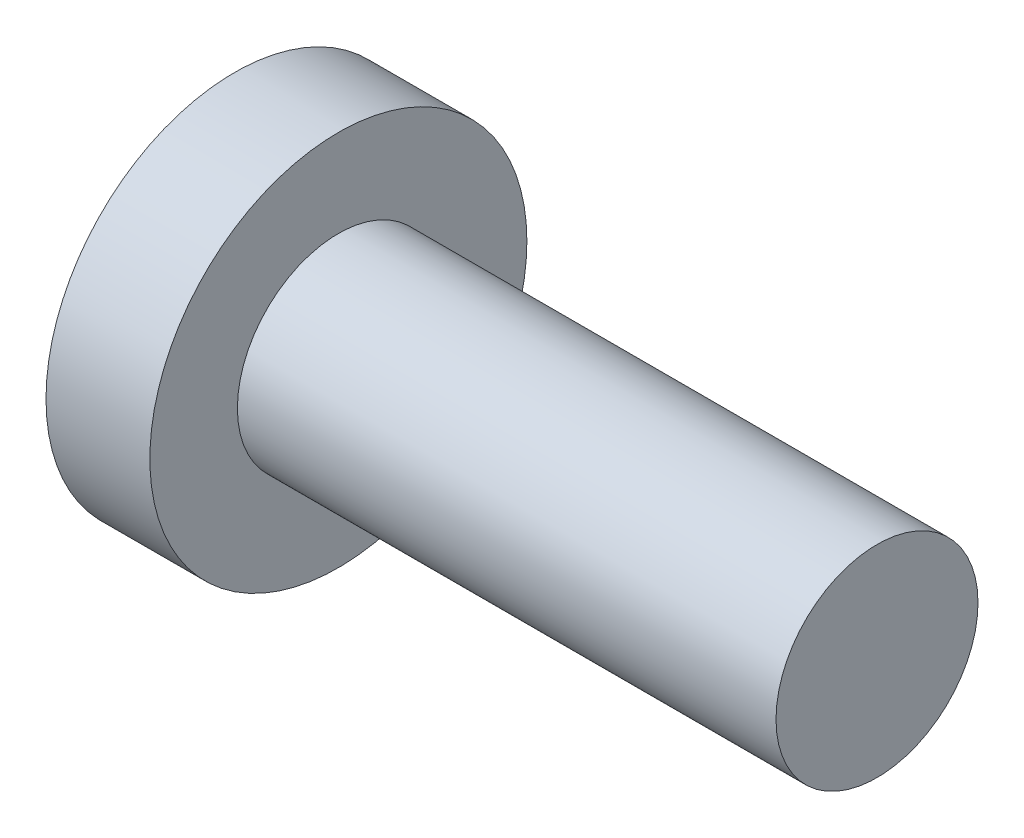
ISO-10303-21;
HEADER;
FILE_DESCRIPTION(('STEP AP214'),'2;1');
FILE_NAME('part.step','',(''),(''),'','','');
FILE_SCHEMA(('AUTOMOTIVE_DESIGN { 1 0 10303 214 1 1 1 1 }'));
ENDSEC;
DATA;
#1=APPLICATION_CONTEXT('core data for automotive mechanical design processes');
#2=APPLICATION_PROTOCOL_DEFINITION('international standard','automotive_design',2000,#1);
#3=PRODUCT_CONTEXT('',#1,'mechanical');
#4=PRODUCT('Part','Part','',(#3));
#5=PRODUCT_RELATED_PRODUCT_CATEGORY('part','',(#4));
#6=PRODUCT_DEFINITION_FORMATION('','',#4);
#7=PRODUCT_DEFINITION_CONTEXT('part definition',#1,'design');
#8=PRODUCT_DEFINITION('design','',#6,#7);
#9=PRODUCT_DEFINITION_SHAPE('','',#8);
#10=(LENGTH_UNIT() NAMED_UNIT(*) SI_UNIT(.MILLI.,.METRE.));
#11=(NAMED_UNIT(*) PLANE_ANGLE_UNIT() SI_UNIT($,.RADIAN.));
#12=(NAMED_UNIT(*) SI_UNIT($,.STERADIAN.) SOLID_ANGLE_UNIT());
#13=UNCERTAINTY_MEASURE_WITH_UNIT(LENGTH_MEASURE(1.E-05),#10,'distance_accuracy_value','');
#14=(GEOMETRIC_REPRESENTATION_CONTEXT(3) GLOBAL_UNCERTAINTY_ASSIGNED_CONTEXT((#13)) GLOBAL_UNIT_ASSIGNED_CONTEXT((#10,
#11,#12)) REPRESENTATION_CONTEXT('',''));
#15=CARTESIAN_POINT('',(0.,0.,0.));
#16=DIRECTION('',(0.,0.,1.));
#17=DIRECTION('',(1.,0.,0.));
#18=AXIS2_PLACEMENT_3D('',#15,#16,#17);
#19=CARTESIAN_POINT('',(5.,0.,0.));
#20=DIRECTION('',(1.,0.,0.));
#21=DIRECTION('',(0.,1.,0.));
#22=AXIS2_PLACEMENT_3D('',#19,#20,#21);
#23=SPHERICAL_SURFACE('',#22,5.);
#24=CARTESIAN_POINT('',(0.857536964558404,0.,0.));
#25=DIRECTION('',(1.,0.,0.));
#26=DIRECTION('',(0.,0.,-1.));
#27=AXIS2_PLACEMENT_3D('',#24,#25,#26);
#28=CIRCLE('',#27,2.8);
#29=CARTESIAN_POINT('',(0.857536964558404,0.,-2.8));
#30=VERTEX_POINT('',#29);
#31=EDGE_CURVE('E236',#30,#30,#28,.T.);
#32=ORIENTED_EDGE('',*,*,#31,.F.);
#33=EDGE_LOOP('',(#32));
#34=FACE_BOUND('',#33,.T.);
#35=CARTESIAN_POINT('',(5.,-0.3,0.));
#36=DIRECTION('',(0.,1.,0.));
#37=DIRECTION('',(0.,0.,1.));
#38=AXIS2_PLACEMENT_3D('',#35,#36,#37);
#39=CIRCLE('',#38,4.99099188538711);
#40=CARTESIAN_POINT('',(0.204192141108151,-0.3,1.3821096123648));
#41=VERTEX_POINT('',#40);
#42=CARTESIAN_POINT('',(0.0452043432650024,-0.3,0.6));
#43=VERTEX_POINT('',#42);
#44=EDGE_CURVE('E162',#41,#43,#39,.F.);
#45=ORIENTED_EDGE('',*,*,#44,.T.);
#46=CARTESIAN_POINT('',(0.0452043432650024,-0.3,0.6));
#47=CARTESIAN_POINT('',(0.0431803765733258,-0.299985307216759,0.58330066442328));
#48=CARTESIAN_POINT('',(0.0413275176268076,-0.301393621844251,0.56658131014707));
#49=CARTESIAN_POINT('',(0.0380100157488106,-0.306971694528783,0.533576799844294));
#50=CARTESIAN_POINT('',(0.0365452230698608,-0.311140385229224,0.517291478520808));
#51=CARTESIAN_POINT('',(0.0340472247062486,-0.322159146630374,0.485603015386071));
#52=CARTESIAN_POINT('',(0.0330143639783939,-0.329011352060552,0.470200587124305));
#53=CARTESIAN_POINT('',(0.0314127307694625,-0.345205676257373,0.440745323067069));
#54=CARTESIAN_POINT('',(0.0308438058607194,-0.354546975884403,0.426692045343612));
#55=CARTESIAN_POINT('',(0.0301895329231602,-0.375375503630217,0.400444519821415));
#56=CARTESIAN_POINT('',(0.0301004392402797,-0.386845384782284,0.38823659768892));
#57=CARTESIAN_POINT('',(0.0303984595749411,-0.411653153039893,0.365897305977699));
#58=CARTESIAN_POINT('',(0.0307856444365276,-0.424991317781719,0.355766245583269));
#59=CARTESIAN_POINT('',(0.0320223810339676,-0.453099677373167,0.337899284835798));
#60=CARTESIAN_POINT('',(0.0328703456862312,-0.467864814543113,0.33015530522925));
#61=CARTESIAN_POINT('',(0.0350026994062988,-0.498444042646254,0.317225069756468));
#62=CARTESIAN_POINT('',(0.0362869304045913,-0.514257751989369,0.312037889168157));
#63=CARTESIAN_POINT('',(0.0388210734003054,-0.541786224745504,0.305467740201196));
#64=CARTESIAN_POINT('',(0.0399723661586706,-0.553355690495333,0.303417160437875));
#65=CARTESIAN_POINT('',(0.0424563450668788,-0.576618891467464,0.300683149774227));
#66=CARTESIAN_POINT('',(0.0437887689490354,-0.588312424882147,0.299997764205199));
#67=CARTESIAN_POINT('',(0.0452043432650023,-0.6,0.3));
#68=B_SPLINE_CURVE_WITH_KNOTS('',3,(#46,#47,#48,#49,#50,#51,#52,#53,#54,#55,#56,#57,#58,#59,#60,
#61,#62,#63,#64,#65,#66,#67),.UNSPECIFIED.,.F.,.F.,(4,2,2,2,2,2,2,2,2,2,4),(0.,
0.0504040124836523,0.100788546583663,0.151213243139993,0.201621365810884,0.251635416538133,
0.3016569075042,0.351507189411116,0.401339428623963,0.436680545510309,0.471971024931029),.UNSPECIFIED.);
#69=CARTESIAN_POINT('',(0.0452043432650024,-0.6,0.3));
#70=VERTEX_POINT('',#69);
#71=EDGE_CURVE('E147',#43,#70,#68,.T.);
#72=ORIENTED_EDGE('',*,*,#71,.T.);
#73=CARTESIAN_POINT('',(5.,0.,0.3));
#74=DIRECTION('',(0.,0.,-1.));
#75=DIRECTION('',(0.,1.,0.));
#76=AXIS2_PLACEMENT_3D('',#73,#74,#75);
#77=CIRCLE('',#76,4.99099188538711);
#78=CARTESIAN_POINT('',(0.204192141108152,-1.3821096123648,0.299999999999999));
#79=VERTEX_POINT('',#78);
#80=EDGE_CURVE('E171',#70,#79,#77,.F.);
#81=ORIENTED_EDGE('',*,*,#80,.T.);
#82=CARTESIAN_POINT('',(4.39951905283833,1.0400635094611,0.));
#83=DIRECTION('',(-0.500000000000001,0.866025403784438,0.));
#84=DIRECTION('',(-0.866025403784438,-0.500000000000001,0.));
#85=AXIS2_PLACEMENT_3D('',#82,#83,#84);
#86=CIRCLE('',#85,4.8536265336739);
#87=CARTESIAN_POINT('',(0.204192141108152,-1.3821096123648,-0.3));
#88=VERTEX_POINT('',#87);
#89=EDGE_CURVE('E174',#79,#88,#86,.F.);
#90=ORIENTED_EDGE('',*,*,#89,.T.);
#91=CARTESIAN_POINT('',(5.,0.,-0.3));
#92=DIRECTION('',(0.,0.,1.));
#93=DIRECTION('',(1.,0.,0.));
#94=AXIS2_PLACEMENT_3D('',#91,#92,#93);
#95=CIRCLE('',#94,4.99099188538711);
#96=CARTESIAN_POINT('',(0.0452043432650024,-0.6,-0.3));
#97=VERTEX_POINT('',#96);
#98=EDGE_CURVE('E264',#88,#97,#95,.F.);
#99=ORIENTED_EDGE('',*,*,#98,.T.);
#100=CARTESIAN_POINT('',(0.0452043432650024,-0.6,-0.3));
#101=CARTESIAN_POINT('',(0.0431803765733258,-0.58330066442328,-0.299985307216759));
#102=CARTESIAN_POINT('',(0.0413275176268076,-0.56658131014707,-0.301393621844251));
#103=CARTESIAN_POINT('',(0.0380100157488106,-0.533576799844295,-0.306971694528783));
#104=CARTESIAN_POINT('',(0.0365452230698608,-0.517291478520808,-0.311140385229224));
#105=CARTESIAN_POINT('',(0.0340472247062486,-0.485603015386071,-0.322159146630374));
#106=CARTESIAN_POINT('',(0.0330143639783939,-0.470200587124306,-0.329011352060552));
#107=CARTESIAN_POINT('',(0.0314127307694625,-0.44074532306707,-0.345205676257373));
#108=CARTESIAN_POINT('',(0.0308438058607194,-0.426692045343612,-0.354546975884403));
#109=CARTESIAN_POINT('',(0.0301895329231602,-0.400444519821416,-0.375375503630217));
#110=CARTESIAN_POINT('',(0.0301004392402796,-0.388236597688921,-0.386845384782284));
#111=CARTESIAN_POINT('',(0.0303984595749411,-0.3658973059777,-0.411653153039893));
#112=CARTESIAN_POINT('',(0.0307856444365276,-0.355766245583269,-0.424991317781719));
#113=CARTESIAN_POINT('',(0.0320223810339676,-0.337899284835798,-0.453099677373167));
#114=CARTESIAN_POINT('',(0.0328703456862312,-0.330155305229251,-0.467864814543113));
#115=CARTESIAN_POINT('',(0.0350026994062988,-0.317225069756469,-0.498444042646254));
#116=CARTESIAN_POINT('',(0.0362869304045913,-0.312037889168157,-0.514257751989369));
#117=CARTESIAN_POINT('',(0.0388210734003054,-0.305467740201196,-0.541786224745504));
#118=CARTESIAN_POINT('',(0.0399723661586706,-0.303417160437876,-0.553355690495333));
#119=CARTESIAN_POINT('',(0.0424563450668788,-0.300683149774227,-0.576618891467464));
#120=CARTESIAN_POINT('',(0.0437887689490354,-0.299997764205199,-0.588312424882147));
#121=CARTESIAN_POINT('',(0.0452043432650023,-0.3,-0.6));
#122=B_SPLINE_CURVE_WITH_KNOTS('',3,(#100,#101,#102,#103,#104,#105,#106,#107,#108,#109,#110,
#111,#112,#113,#114,#115,#116,#117,#118,#119,#120,#121),.UNSPECIFIED.,.F.,.F.,(4,2,2,2,2,2,2,2,
2,2,4),(0.,0.0504040124836523,0.100788546583663,0.151213243139993,0.201621365810883,
0.251635416538133,0.3016569075042,0.351507189411116,0.401339428623963,0.436680545510309,
0.471971024931029),.UNSPECIFIED.);
#123=CARTESIAN_POINT('',(0.0452043432650024,-0.3,-0.6));
#124=VERTEX_POINT('',#123);
#125=EDGE_CURVE('E158',#97,#124,#122,.T.);
#126=ORIENTED_EDGE('',*,*,#125,.T.);
#127=CARTESIAN_POINT('',(5.,-0.3,0.));
#128=DIRECTION('',(0.,1.,0.));
#129=DIRECTION('',(0.,0.,1.));
#130=AXIS2_PLACEMENT_3D('',#127,#128,#129);
#131=CIRCLE('',#130,4.99099188538711);
#132=CARTESIAN_POINT('',(0.204192141108152,-0.3,-1.3821096123648));
#133=VERTEX_POINT('',#132);
#134=EDGE_CURVE('E263',#124,#133,#131,.F.);
#135=ORIENTED_EDGE('',*,*,#134,.T.);
#136=CARTESIAN_POINT('',(4.39951905283833,0.,1.0400635094611));
#137=DIRECTION('',(-0.500000000000001,0.,0.866025403784438));
#138=DIRECTION('',(0.866025403784438,0.,0.500000000000001));
#139=AXIS2_PLACEMENT_3D('',#136,#137,#138);
#140=CIRCLE('',#139,4.8536265336739);
#141=CARTESIAN_POINT('',(0.204192141108152,0.3,-1.3821096123648));
#142=VERTEX_POINT('',#141);
#143=EDGE_CURVE('E262',#133,#142,#140,.F.);
#144=ORIENTED_EDGE('',*,*,#143,.T.);
#145=CARTESIAN_POINT('',(5.,0.3,0.));
#146=DIRECTION('',(0.,-1.,0.));
#147=DIRECTION('',(0.,0.,-1.));
#148=AXIS2_PLACEMENT_3D('',#145,#146,#147);
#149=CIRCLE('',#148,4.99099188538711);
#150=CARTESIAN_POINT('',(0.0452043432650024,0.3,-0.6));
#151=VERTEX_POINT('',#150);
#152=EDGE_CURVE('E259',#142,#151,#149,.F.);
#153=ORIENTED_EDGE('',*,*,#152,.T.);
#154=CARTESIAN_POINT('',(0.0452043432650024,0.3,-0.6));
#155=CARTESIAN_POINT('',(0.0431803765733264,0.299985307216759,-0.58330066442328));
#156=CARTESIAN_POINT('',(0.0413275176268081,0.301393621844251,-0.56658131014707));
#157=CARTESIAN_POINT('',(0.0380100157488108,0.306971694528783,-0.533576799844295));
#158=CARTESIAN_POINT('',(0.0365452230698607,0.311140385229223,-0.517291478520809));
#159=CARTESIAN_POINT('',(0.0340472247062487,0.322159146630374,-0.485603015386071));
#160=CARTESIAN_POINT('',(0.0330143639783944,0.329011352060552,-0.470200587124306));
#161=CARTESIAN_POINT('',(0.0314127307694625,0.345205676257373,-0.44074532306707));
#162=CARTESIAN_POINT('',(0.0308438058607185,0.354546975884403,-0.426692045343612));
#163=CARTESIAN_POINT('',(0.0301895329231594,0.375375503630217,-0.400444519821416));
#164=CARTESIAN_POINT('',(0.0301004392402797,0.386845384782284,-0.388236597688921));
#165=CARTESIAN_POINT('',(0.0303984595749418,0.411653153039893,-0.3658973059777));
#166=CARTESIAN_POINT('',(0.030785644436528,0.424991317781719,-0.355766245583269));
#167=CARTESIAN_POINT('',(0.0320223810339672,0.453099677373167,-0.337899284835798));
#168=CARTESIAN_POINT('',(0.0328703456862304,0.467864814543113,-0.330155305229251));
#169=CARTESIAN_POINT('',(0.0350026994062981,0.498444042646254,-0.317225069756469));
#170=CARTESIAN_POINT('',(0.0362869304045911,0.514257751989369,-0.312037889168158));
#171=CARTESIAN_POINT('',(0.0388210734003055,0.541786224745504,-0.305467740201196));
#172=CARTESIAN_POINT('',(0.0399723661586706,0.553355690495333,-0.303417160437876));
#173=CARTESIAN_POINT('',(0.0424563450668787,0.576618891467464,-0.300683149774227));
#174=CARTESIAN_POINT('',(0.0437887689490352,0.588312424882147,-0.299997764205199));
#175=CARTESIAN_POINT('',(0.0452043432650023,0.6,-0.3));
#176=B_SPLINE_CURVE_WITH_KNOTS('',3,(#154,#155,#156,#157,#158,#159,#160,#161,#162,#163,#164,
#165,#166,#167,#168,#169,#170,#171,#172,#173,#174,#175),.UNSPECIFIED.,.F.,.F.,(4,2,2,2,2,2,2,2,
2,2,4),(0.,0.0504040124836523,0.100788546583663,0.151213243139993,0.201621365810884,
0.251635416538133,0.3016569075042,0.351507189411116,0.401339428623963,0.436680545510309,
0.471971024931029),.UNSPECIFIED.);
#177=CARTESIAN_POINT('',(0.0452043432650024,0.6,-0.3));
#178=VERTEX_POINT('',#177);
#179=EDGE_CURVE('E165',#151,#178,#176,.T.);
#180=ORIENTED_EDGE('',*,*,#179,.T.);
#181=CARTESIAN_POINT('',(5.,0.,-0.3));
#182=DIRECTION('',(0.,0.,1.));
#183=DIRECTION('',(1.,0.,0.));
#184=AXIS2_PLACEMENT_3D('',#181,#182,#183);
#185=CIRCLE('',#184,4.99099188538711);
#186=CARTESIAN_POINT('',(0.204192141108152,1.3821096123648,-0.3));
#187=VERTEX_POINT('',#186);
#188=EDGE_CURVE('E257',#178,#187,#185,.F.);
#189=ORIENTED_EDGE('',*,*,#188,.T.);
#190=CARTESIAN_POINT('',(4.39951905283833,-1.0400635094611,0.));
#191=DIRECTION('',(-0.500000000000001,-0.866025403784438,0.));
#192=DIRECTION('',(0.866025403784438,-0.500000000000001,0.));
#193=AXIS2_PLACEMENT_3D('',#190,#191,#192);
#194=CIRCLE('',#193,4.8536265336739);
#195=CARTESIAN_POINT('',(0.204192141108152,1.3821096123648,0.3));
#196=VERTEX_POINT('',#195);
#197=EDGE_CURVE('E256',#187,#196,#194,.F.);
#198=ORIENTED_EDGE('',*,*,#197,.T.);
#199=CARTESIAN_POINT('',(5.,0.,0.3));
#200=DIRECTION('',(0.,0.,-1.));
#201=DIRECTION('',(0.,1.,0.));
#202=AXIS2_PLACEMENT_3D('',#199,#200,#201);
#203=CIRCLE('',#202,4.99099188538711);
#204=CARTESIAN_POINT('',(0.0452043432650024,0.6,0.3));
#205=VERTEX_POINT('',#204);
#206=EDGE_CURVE('E253',#196,#205,#203,.F.);
#207=ORIENTED_EDGE('',*,*,#206,.T.);
#208=CARTESIAN_POINT('',(0.0452043432650024,0.6,0.3));
#209=CARTESIAN_POINT('',(0.0431803765733264,0.58330066442328,0.299985307216759));
#210=CARTESIAN_POINT('',(0.0413275176268081,0.56658131014707,0.30139362184425));
#211=CARTESIAN_POINT('',(0.0380100157488108,0.533576799844294,0.306971694528782));
#212=CARTESIAN_POINT('',(0.0365452230698607,0.517291478520808,0.311140385229223));
#213=CARTESIAN_POINT('',(0.0340472247062487,0.485603015386071,0.322159146630374));
#214=CARTESIAN_POINT('',(0.0330143639783944,0.470200587124306,0.329011352060551));
#215=CARTESIAN_POINT('',(0.0314127307694625,0.44074532306707,0.345205676257373));
#216=CARTESIAN_POINT('',(0.0308438058607185,0.426692045343612,0.354546975884403));
#217=CARTESIAN_POINT('',(0.0301895329231594,0.400444519821416,0.375375503630217));
#218=CARTESIAN_POINT('',(0.0301004392402797,0.38823659768892,0.386845384782283));
#219=CARTESIAN_POINT('',(0.0303984595749418,0.365897305977699,0.411653153039892));
#220=CARTESIAN_POINT('',(0.030785644436528,0.355766245583269,0.424991317781719));
#221=CARTESIAN_POINT('',(0.0320223810339672,0.337899284835798,0.453099677373167));
#222=CARTESIAN_POINT('',(0.0328703456862304,0.33015530522925,0.467864814543113));
#223=CARTESIAN_POINT('',(0.0350026994062981,0.317225069756469,0.498444042646254));
#224=CARTESIAN_POINT('',(0.0362869304045911,0.312037889168157,0.514257751989368));
#225=CARTESIAN_POINT('',(0.0388210734003054,0.305467740201196,0.541786224745503));
#226=CARTESIAN_POINT('',(0.0399723661586706,0.303417160437875,0.553355690495333));
#227=CARTESIAN_POINT('',(0.0424563450668787,0.300683149774227,0.576618891467463));
#228=CARTESIAN_POINT('',(0.0437887689490352,0.299997764205199,0.588312424882147));
#229=CARTESIAN_POINT('',(0.0452043432650023,0.3,0.6));
#230=B_SPLINE_CURVE_WITH_KNOTS('',3,(#208,#209,#210,#211,#212,#213,#214,#215,#216,#217,#218,
#219,#220,#221,#222,#223,#224,#225,#226,#227,#228,#229),.UNSPECIFIED.,.F.,.F.,(4,2,2,2,2,2,2,2,
2,2,4),(0.,0.0504040124836523,0.100788546583663,0.151213243139993,0.201621365810883,
0.251635416538133,0.3016569075042,0.351507189411116,0.401339428623963,0.436680545510309,
0.471971024931029),.UNSPECIFIED.);
#231=CARTESIAN_POINT('',(0.0452043432650024,0.3,0.6));
#232=VERTEX_POINT('',#231);
#233=EDGE_CURVE('E185',#205,#232,#230,.T.);
#234=ORIENTED_EDGE('',*,*,#233,.T.);
#235=CARTESIAN_POINT('',(5.,0.3,0.));
#236=DIRECTION('',(0.,-1.,0.));
#237=DIRECTION('',(0.,0.,-1.));
#238=AXIS2_PLACEMENT_3D('',#235,#236,#237);
#239=CIRCLE('',#238,4.99099188538711);
#240=CARTESIAN_POINT('',(0.204192141108151,0.3,1.3821096123648));
#241=VERTEX_POINT('',#240);
#242=EDGE_CURVE('E166',#232,#241,#239,.F.);
#243=ORIENTED_EDGE('',*,*,#242,.T.);
#244=CARTESIAN_POINT('',(4.39951905283832,0.,-1.0400635094611));
#245=DIRECTION('',(-0.500000000000001,0.,-0.866025403784438));
#246=DIRECTION('',(-0.866025403784438,0.,0.500000000000001));
#247=AXIS2_PLACEMENT_3D('',#244,#245,#246);
#248=CIRCLE('',#247,4.8536265336739);
#249=EDGE_CURVE('E170',#241,#41,#248,.F.);
#250=ORIENTED_EDGE('',*,*,#249,.T.);
#251=EDGE_LOOP('',(#45,#72,#81,#90,#99,#126,#135,#144,#153,#180,#189,#198,#207,#234,#243,#250));
#252=FACE_BOUND('',#251,.T.);
#253=ADVANCED_FACE('F37',(#34,#252),#23,.T.);
#254=CARTESIAN_POINT('',(10.4,1.5,0.));
#255=DIRECTION('',(1.,0.,0.));
#256=DIRECTION('',(0.,0.,-1.));
#257=AXIS2_PLACEMENT_3D('',#254,#255,#256);
#258=PLANE('',#257);
#259=CARTESIAN_POINT('',(10.4,0.,0.));
#260=DIRECTION('',(1.,0.,0.));
#261=DIRECTION('',(0.,0.,-1.));
#262=AXIS2_PLACEMENT_3D('',#259,#260,#261);
#263=CIRCLE('',#262,1.5);
#264=CARTESIAN_POINT('',(10.4,0.,-1.5));
#265=VERTEX_POINT('',#264);
#266=EDGE_CURVE('E250',#265,#265,#263,.T.);
#267=ORIENTED_EDGE('',*,*,#266,.T.);
#268=EDGE_LOOP('',(#267));
#269=FACE_BOUND('',#268,.T.);
#270=ADVANCED_FACE('F226',(#269),#258,.T.);
#271=CARTESIAN_POINT('',(4.51581291088132,0.,0.));
#272=DIRECTION('',(1.,0.,0.));
#273=DIRECTION('',(0.,0.,-1.));
#274=AXIS2_PLACEMENT_3D('',#271,#272,#273);
#275=CYLINDRICAL_SURFACE('',#274,1.5);
#276=CARTESIAN_POINT('',(2.4,0.,0.));
#277=DIRECTION('',(1.,0.,0.));
#278=DIRECTION('',(0.,0.,-1.));
#279=AXIS2_PLACEMENT_3D('',#276,#277,#278);
#280=CIRCLE('',#279,1.5);
#281=CARTESIAN_POINT('',(2.4,0.,-1.5));
#282=VERTEX_POINT('',#281);
#283=EDGE_CURVE('E243',#282,#282,#280,.T.);
#284=ORIENTED_EDGE('',*,*,#283,.T.);
#285=EDGE_LOOP('',(#284));
#286=FACE_BOUND('',#285,.T.);
#287=ORIENTED_EDGE('',*,*,#266,.F.);
#288=EDGE_LOOP('',(#287));
#289=FACE_BOUND('',#288,.T.);
#290=ADVANCED_FACE('F231',(#286,#289),#275,.T.);
#291=CARTESIAN_POINT('',(2.4,1.8,0.));
#292=DIRECTION('',(1.,0.,0.));
#293=DIRECTION('',(0.,0.,-1.));
#294=AXIS2_PLACEMENT_3D('',#291,#292,#293);
#295=PLANE('',#294);
#296=CARTESIAN_POINT('',(2.4,0.,0.));
#297=DIRECTION('',(1.,0.,0.));
#298=DIRECTION('',(0.,0.,-1.));
#299=AXIS2_PLACEMENT_3D('',#296,#297,#298);
#300=CIRCLE('',#299,2.8);
#301=CARTESIAN_POINT('',(2.4,0.,-2.8));
#302=VERTEX_POINT('',#301);
#303=EDGE_CURVE('E238',#302,#302,#300,.T.);
#304=ORIENTED_EDGE('',*,*,#303,.T.);
#305=EDGE_LOOP('',(#304));
#306=FACE_BOUND('',#305,.T.);
#307=ORIENTED_EDGE('',*,*,#283,.F.);
#308=EDGE_LOOP('',(#307));
#309=FACE_BOUND('',#308,.T.);
#310=ADVANCED_FACE('F508',(#306,#309),#295,.T.);
#311=CARTESIAN_POINT('',(4.51581291088132,0.,0.));
#312=DIRECTION('',(1.,0.,0.));
#313=DIRECTION('',(0.,0.,-1.));
#314=AXIS2_PLACEMENT_3D('',#311,#312,#313);
#315=CYLINDRICAL_SURFACE('',#314,2.8);
#316=ORIENTED_EDGE('',*,*,#31,.T.);
#317=EDGE_LOOP('',(#316));
#318=FACE_BOUND('',#317,.T.);
#319=ORIENTED_EDGE('',*,*,#303,.F.);
#320=EDGE_LOOP('',(#319));
#321=FACE_BOUND('',#320,.T.);
#322=ADVANCED_FACE('F222',(#318,#321),#315,.T.);
#323=CARTESIAN_POINT('',(1.68,0.3,0.3));
#324=DIRECTION('',(0.,-1.,0.));
#325=DIRECTION('',(0.,0.,-1.));
#326=AXIS2_PLACEMENT_3D('',#323,#324,#325);
#327=PLANE('',#326);
#328=ORIENTED_EDGE('',*,*,#242,.F.);
#329=DIRECTION('',(-1.,0.,0.));
#330=VECTOR('',#329,1.);
#331=CARTESIAN_POINT('',(1.68,0.3,0.6));
#332=LINE('',#331,#330);
#333=CARTESIAN_POINT('',(1.55884572681198,0.3,0.6));
#334=VERTEX_POINT('',#333);
#335=EDGE_CURVE('E341',#232,#334,#332,.F.);
#336=ORIENTED_EDGE('',*,*,#335,.T.);
#337=DIRECTION('',(-0.866025403784438,0.,0.500000000000001));
#338=VECTOR('',#337,1.);
#339=CARTESIAN_POINT('',(0.,0.3,1.5));
#340=LINE('',#339,#338);
#341=EDGE_CURVE('E239',#334,#241,#340,.T.);
#342=ORIENTED_EDGE('',*,*,#341,.T.);
#343=EDGE_LOOP('',(#328,#336,#342));
#344=FACE_BOUND('',#343,.T.);
#345=ADVANCED_FACE('F215',(#344),#327,.T.);
#346=CARTESIAN_POINT('',(0.,0.,1.5));
#347=DIRECTION('',(-0.500000000000001,0.,-0.866025403784438));
#348=DIRECTION('',(-0.866025403784438,0.,0.500000000000001));
#349=AXIS2_PLACEMENT_3D('',#346,#347,#348);
#350=PLANE('',#349);
#351=ORIENTED_EDGE('',*,*,#341,.F.);
#352=CARTESIAN_POINT('',(1.55884572681198,0.6,0.6));
#353=DIRECTION('',(-0.500000000000001,0.,-0.866025403784438));
#354=DIRECTION('',(-0.866025403784438,0.,0.500000000000001));
#355=AXIS2_PLACEMENT_3D('',#352,#353,#354);
#356=ELLIPSE('',#355,0.599999999999999,0.3);
#357=CARTESIAN_POINT('',(1.68,0.308268592658542,0.530051547761425));
#358=VERTEX_POINT('',#357);
#359=EDGE_CURVE('E308',#334,#358,#356,.F.);
#360=ORIENTED_EDGE('',*,*,#359,.T.);
#361=DIRECTION('',(0.,-1.,0.));
#362=VECTOR('',#361,1.);
#363=CARTESIAN_POINT('',(1.68,0.,0.530051547761425));
#364=LINE('',#363,#362);
#365=CARTESIAN_POINT('',(1.68,-0.308268592658542,0.530051547761425));
#366=VERTEX_POINT('',#365);
#367=EDGE_CURVE('E280',#358,#366,#364,.T.);
#368=ORIENTED_EDGE('',*,*,#367,.T.);
#369=CARTESIAN_POINT('',(1.55884572681198,-0.6,0.6));
#370=DIRECTION('',(-0.500000000000001,0.,-0.866025403784438));
#371=DIRECTION('',(-0.866025403784438,0.,0.500000000000001));
#372=AXIS2_PLACEMENT_3D('',#369,#370,#371);
#373=ELLIPSE('',#372,0.599999999999999,0.3);
#374=CARTESIAN_POINT('',(1.55884572681198,-0.3,0.6));
#375=VERTEX_POINT('',#374);
#376=EDGE_CURVE('E303',#375,#366,#373,.T.);
#377=ORIENTED_EDGE('',*,*,#376,.F.);
#378=DIRECTION('',(-0.866025403784438,0.,0.500000000000001));
#379=VECTOR('',#378,1.);
#380=CARTESIAN_POINT('',(1.77961524227066,-0.3,0.472538660821069));
#381=LINE('',#380,#379);
#382=EDGE_CURVE('E164',#375,#41,#381,.T.);
#383=ORIENTED_EDGE('',*,*,#382,.T.);
#384=ORIENTED_EDGE('',*,*,#249,.F.);
#385=EDGE_LOOP('',(#351,#360,#368,#377,#383,#384));
#386=FACE_BOUND('',#385,.T.);
#387=ADVANCED_FACE('F213',(#386),#350,.T.);
#388=CARTESIAN_POINT('',(1.68,-0.3,0.3));
#389=DIRECTION('',(0.,1.,0.));
#390=DIRECTION('',(0.,0.,1.));
#391=AXIS2_PLACEMENT_3D('',#388,#389,#390);
#392=PLANE('',#391);
#393=ORIENTED_EDGE('',*,*,#382,.F.);
#394=DIRECTION('',(-1.,0.,0.));
#395=VECTOR('',#394,1.);
#396=CARTESIAN_POINT('',(1.68,-0.3,0.6));
#397=LINE('',#396,#395);
#398=EDGE_CURVE('E151',#375,#43,#397,.T.);
#399=ORIENTED_EDGE('',*,*,#398,.T.);
#400=ORIENTED_EDGE('',*,*,#44,.F.);
#401=EDGE_LOOP('',(#393,#399,#400));
#402=FACE_BOUND('',#401,.T.);
#403=ADVANCED_FACE('F161',(#402),#392,.T.);
#404=CARTESIAN_POINT('',(1.68,-0.3,0.3));
#405=DIRECTION('',(0.,0.,-1.));
#406=DIRECTION('',(0.,1.,0.));
#407=AXIS2_PLACEMENT_3D('',#404,#405,#406);
#408=PLANE('',#407);
#409=ORIENTED_EDGE('',*,*,#80,.F.);
#410=DIRECTION('',(-1.,0.,0.));
#411=VECTOR('',#410,1.);
#412=CARTESIAN_POINT('',(1.68,-0.6,0.3));
#413=LINE('',#412,#411);
#414=CARTESIAN_POINT('',(1.55884572681199,-0.6,0.3));
#415=VERTEX_POINT('',#414);
#416=EDGE_CURVE('E154',#70,#415,#413,.F.);
#417=ORIENTED_EDGE('',*,*,#416,.T.);
#418=DIRECTION('',(-0.866025403784438,-0.500000000000001,0.));
#419=VECTOR('',#418,1.);
#420=CARTESIAN_POINT('',(0.,-1.5,0.299999999999999));
#421=LINE('',#420,#419);
#422=EDGE_CURVE('E271',#415,#79,#421,.T.);
#423=ORIENTED_EDGE('',*,*,#422,.T.);
#424=EDGE_LOOP('',(#409,#417,#423));
#425=FACE_BOUND('',#424,.T.);
#426=ADVANCED_FACE('F206',(#425),#408,.T.);
#427=CARTESIAN_POINT('',(0.,-1.5,0.));
#428=DIRECTION('',(-0.500000000000001,0.866025403784438,0.));
#429=DIRECTION('',(-0.866025403784438,-0.500000000000001,0.));
#430=AXIS2_PLACEMENT_3D('',#427,#428,#429);
#431=PLANE('',#430);
#432=ORIENTED_EDGE('',*,*,#422,.F.);
#433=CARTESIAN_POINT('',(1.55884572681199,-0.6,0.6));
#434=DIRECTION('',(-0.500000000000001,0.866025403784438,0.));
#435=DIRECTION('',(-0.866025403784438,-0.500000000000001,0.));
#436=AXIS2_PLACEMENT_3D('',#433,#434,#435);
#437=ELLIPSE('',#436,0.599999999999999,0.3);
#438=CARTESIAN_POINT('',(1.68,-0.530051547761426,0.308268592658541));
#439=VERTEX_POINT('',#438);
#440=EDGE_CURVE('E283',#415,#439,#437,.F.);
#441=ORIENTED_EDGE('',*,*,#440,.T.);
#442=DIRECTION('',(0.,0.,-1.));
#443=VECTOR('',#442,1.);
#444=CARTESIAN_POINT('',(1.68,-0.530051547761426,0.));
#445=LINE('',#444,#443);
#446=CARTESIAN_POINT('',(1.68,-0.530051547761426,-0.308268592658542));
#447=VERTEX_POINT('',#446);
#448=EDGE_CURVE('E277',#439,#447,#445,.T.);
#449=ORIENTED_EDGE('',*,*,#448,.T.);
#450=CARTESIAN_POINT('',(1.55884572681199,-0.6,-0.6));
#451=DIRECTION('',(-0.500000000000001,0.866025403784438,0.));
#452=DIRECTION('',(-0.866025403784438,-0.500000000000001,0.));
#453=AXIS2_PLACEMENT_3D('',#450,#451,#452);
#454=ELLIPSE('',#453,0.599999999999999,0.3);
#455=CARTESIAN_POINT('',(1.55884572681199,-0.6,-0.3));
#456=VERTEX_POINT('',#455);
#457=EDGE_CURVE('E281',#456,#447,#454,.T.);
#458=ORIENTED_EDGE('',*,*,#457,.F.);
#459=DIRECTION('',(-0.866025403784438,-0.500000000000001,0.));
#460=VECTOR('',#459,1.);
#461=CARTESIAN_POINT('',(1.77961524227066,-0.47253866082107,-0.3));
#462=LINE('',#461,#460);
#463=EDGE_CURVE('E273',#456,#88,#462,.T.);
#464=ORIENTED_EDGE('',*,*,#463,.T.);
#465=ORIENTED_EDGE('',*,*,#89,.F.);
#466=EDGE_LOOP('',(#432,#441,#449,#458,#464,#465));
#467=FACE_BOUND('',#466,.T.);
#468=ADVANCED_FACE('F202',(#467),#431,.T.);
#469=CARTESIAN_POINT('',(1.68,-0.3,-0.3));
#470=DIRECTION('',(0.,0.,1.));
#471=DIRECTION('',(1.,0.,0.));
#472=AXIS2_PLACEMENT_3D('',#469,#470,#471);
#473=PLANE('',#472);
#474=ORIENTED_EDGE('',*,*,#463,.F.);
#475=DIRECTION('',(-1.,0.,0.));
#476=VECTOR('',#475,1.);
#477=CARTESIAN_POINT('',(1.68,-0.6,-0.3));
#478=LINE('',#477,#476);
#479=EDGE_CURVE('E350',#456,#97,#478,.T.);
#480=ORIENTED_EDGE('',*,*,#479,.T.);
#481=ORIENTED_EDGE('',*,*,#98,.F.);
#482=EDGE_LOOP('',(#474,#480,#481));
#483=FACE_BOUND('',#482,.T.);
#484=ADVANCED_FACE('F205',(#483),#473,.T.);
#485=CARTESIAN_POINT('',(1.68,-0.3,-0.3));
#486=DIRECTION('',(0.,1.,0.));
#487=DIRECTION('',(0.,0.,1.));
#488=AXIS2_PLACEMENT_3D('',#485,#486,#487);
#489=PLANE('',#488);
#490=ORIENTED_EDGE('',*,*,#134,.F.);
#491=DIRECTION('',(-1.,0.,0.));
#492=VECTOR('',#491,1.);
#493=CARTESIAN_POINT('',(1.68,-0.3,-0.6));
#494=LINE('',#493,#492);
#495=CARTESIAN_POINT('',(1.55884572681198,-0.3,-0.6));
#496=VERTEX_POINT('',#495);
#497=EDGE_CURVE('E347',#124,#496,#494,.F.);
#498=ORIENTED_EDGE('',*,*,#497,.T.);
#499=DIRECTION('',(-0.866025403784438,0.,-0.500000000000001));
#500=VECTOR('',#499,1.);
#501=CARTESIAN_POINT('',(0.,-0.3,-1.5));
#502=LINE('',#501,#500);
#503=EDGE_CURVE('E276',#496,#133,#502,.T.);
#504=ORIENTED_EDGE('',*,*,#503,.T.);
#505=EDGE_LOOP('',(#490,#498,#504));
#506=FACE_BOUND('',#505,.T.);
#507=ADVANCED_FACE('F211',(#506),#489,.T.);
#508=CARTESIAN_POINT('',(0.,0.,-1.5));
#509=DIRECTION('',(-0.500000000000001,0.,0.866025403784438));
#510=DIRECTION('',(0.866025403784438,0.,0.500000000000001));
#511=AXIS2_PLACEMENT_3D('',#508,#509,#510);
#512=PLANE('',#511);
#513=ORIENTED_EDGE('',*,*,#503,.F.);
#514=CARTESIAN_POINT('',(1.55884572681198,-0.6,-0.6));
#515=DIRECTION('',(-0.500000000000001,0.,0.866025403784438));
#516=DIRECTION('',(-0.866025403784438,0.,-0.500000000000001));
#517=AXIS2_PLACEMENT_3D('',#514,#515,#516);
#518=ELLIPSE('',#517,0.599999999999999,0.3);
#519=CARTESIAN_POINT('',(1.68,-0.308268592658542,-0.530051547761426));
#520=VERTEX_POINT('',#519);
#521=EDGE_CURVE('E11',#496,#520,#518,.F.);
#522=ORIENTED_EDGE('',*,*,#521,.T.);
#523=DIRECTION('',(0.,1.,0.));
#524=VECTOR('',#523,1.);
#525=CARTESIAN_POINT('',(1.68,0.,-0.530051547761426));
#526=LINE('',#525,#524);
#527=CARTESIAN_POINT('',(1.68,0.308268592658542,-0.530051547761426));
#528=VERTEX_POINT('',#527);
#529=EDGE_CURVE('E279',#520,#528,#526,.T.);
#530=ORIENTED_EDGE('',*,*,#529,.T.);
#531=CARTESIAN_POINT('',(1.55884572681198,0.6,-0.6));
#532=DIRECTION('',(-0.500000000000001,0.,0.866025403784438));
#533=DIRECTION('',(-0.866025403784438,0.,-0.500000000000001));
#534=AXIS2_PLACEMENT_3D('',#531,#532,#533);
#535=ELLIPSE('',#534,0.599999999999999,0.3);
#536=CARTESIAN_POINT('',(1.55884572681198,0.3,-0.6));
#537=VERTEX_POINT('',#536);
#538=EDGE_CURVE('E46',#537,#528,#535,.T.);
#539=ORIENTED_EDGE('',*,*,#538,.F.);
#540=DIRECTION('',(-0.866025403784438,0.,-0.500000000000001));
#541=VECTOR('',#540,1.);
#542=CARTESIAN_POINT('',(1.77961524227066,0.3,-0.472538660821069));
#543=LINE('',#542,#541);
#544=EDGE_CURVE('E291',#537,#142,#543,.T.);
#545=ORIENTED_EDGE('',*,*,#544,.T.);
#546=ORIENTED_EDGE('',*,*,#143,.F.);
#547=EDGE_LOOP('',(#513,#522,#530,#539,#545,#546));
#548=FACE_BOUND('',#547,.T.);
#549=ADVANCED_FACE('F208',(#548),#512,.T.);
#550=CARTESIAN_POINT('',(1.68,0.3,-0.3));
#551=DIRECTION('',(0.,-1.,0.));
#552=DIRECTION('',(0.,0.,-1.));
#553=AXIS2_PLACEMENT_3D('',#550,#551,#552);
#554=PLANE('',#553);
#555=ORIENTED_EDGE('',*,*,#544,.F.);
#556=DIRECTION('',(-1.,0.,0.));
#557=VECTOR('',#556,1.);
#558=CARTESIAN_POINT('',(1.68,0.3,-0.6));
#559=LINE('',#558,#557);
#560=EDGE_CURVE('E322',#537,#151,#559,.T.);
#561=ORIENTED_EDGE('',*,*,#560,.T.);
#562=ORIENTED_EDGE('',*,*,#152,.F.);
#563=EDGE_LOOP('',(#555,#561,#562));
#564=FACE_BOUND('',#563,.T.);
#565=ADVANCED_FACE('F210',(#564),#554,.T.);
#566=CARTESIAN_POINT('',(1.68,0.3,-0.3));
#567=DIRECTION('',(0.,0.,1.));
#568=DIRECTION('',(1.,0.,0.));
#569=AXIS2_PLACEMENT_3D('',#566,#567,#568);
#570=PLANE('',#569);
#571=ORIENTED_EDGE('',*,*,#188,.F.);
#572=DIRECTION('',(-1.,0.,0.));
#573=VECTOR('',#572,1.);
#574=CARTESIAN_POINT('',(1.68,0.6,-0.3));
#575=LINE('',#574,#573);
#576=CARTESIAN_POINT('',(1.55884572681199,0.6,-0.3));
#577=VERTEX_POINT('',#576);
#578=EDGE_CURVE('E337',#178,#577,#575,.F.);
#579=ORIENTED_EDGE('',*,*,#578,.T.);
#580=DIRECTION('',(-0.866025403784438,0.500000000000001,0.));
#581=VECTOR('',#580,1.);
#582=CARTESIAN_POINT('',(0.,1.5,-0.3));
#583=LINE('',#582,#581);
#584=EDGE_CURVE('E288',#577,#187,#583,.T.);
#585=ORIENTED_EDGE('',*,*,#584,.T.);
#586=EDGE_LOOP('',(#571,#579,#585));
#587=FACE_BOUND('',#586,.T.);
#588=ADVANCED_FACE('F384',(#587),#570,.T.);
#589=CARTESIAN_POINT('',(0.,1.5,0.));
#590=DIRECTION('',(-0.500000000000001,-0.866025403784438,0.));
#591=DIRECTION('',(0.866025403784438,-0.500000000000001,0.));
#592=AXIS2_PLACEMENT_3D('',#589,#590,#591);
#593=PLANE('',#592);
#594=ORIENTED_EDGE('',*,*,#584,.F.);
#595=CARTESIAN_POINT('',(1.55884572681199,0.6,-0.6));
#596=DIRECTION('',(-0.500000000000001,-0.866025403784438,0.));
#597=DIRECTION('',(-0.866025403784438,0.500000000000001,0.));
#598=AXIS2_PLACEMENT_3D('',#595,#596,#597);
#599=ELLIPSE('',#598,0.599999999999999,0.3);
#600=CARTESIAN_POINT('',(1.68,0.530051547761426,-0.308268592658542));
#601=VERTEX_POINT('',#600);
#602=EDGE_CURVE('E301',#577,#601,#599,.F.);
#603=ORIENTED_EDGE('',*,*,#602,.T.);
#604=DIRECTION('',(0.,0.,1.));
#605=VECTOR('',#604,1.);
#606=CARTESIAN_POINT('',(1.68,0.530051547761426,0.));
#607=LINE('',#606,#605);
#608=CARTESIAN_POINT('',(1.68,0.530051547761426,0.308268592658541));
#609=VERTEX_POINT('',#608);
#610=EDGE_CURVE('E297',#601,#609,#607,.T.);
#611=ORIENTED_EDGE('',*,*,#610,.T.);
#612=CARTESIAN_POINT('',(1.55884572681199,0.6,0.6));
#613=DIRECTION('',(-0.500000000000001,-0.866025403784438,0.));
#614=DIRECTION('',(-0.866025403784438,0.500000000000001,0.));
#615=AXIS2_PLACEMENT_3D('',#612,#613,#614);
#616=ELLIPSE('',#615,0.599999999999999,0.3);
#617=CARTESIAN_POINT('',(1.55884572681199,0.6,0.3));
#618=VERTEX_POINT('',#617);
#619=EDGE_CURVE('E287',#618,#609,#616,.T.);
#620=ORIENTED_EDGE('',*,*,#619,.F.);
#621=DIRECTION('',(-0.866025403784438,0.500000000000001,0.));
#622=VECTOR('',#621,1.);
#623=CARTESIAN_POINT('',(1.77961524227066,0.47253866082107,0.3));
#624=LINE('',#623,#622);
#625=EDGE_CURVE('E292',#618,#196,#624,.T.);
#626=ORIENTED_EDGE('',*,*,#625,.T.);
#627=ORIENTED_EDGE('',*,*,#197,.F.);
#628=EDGE_LOOP('',(#594,#603,#611,#620,#626,#627));
#629=FACE_BOUND('',#628,.T.);
#630=ADVANCED_FACE('F39',(#629),#593,.T.);
#631=CARTESIAN_POINT('',(1.68,0.3,0.3));
#632=DIRECTION('',(0.,0.,-1.));
#633=DIRECTION('',(0.,1.,0.));
#634=AXIS2_PLACEMENT_3D('',#631,#632,#633);
#635=PLANE('',#634);
#636=ORIENTED_EDGE('',*,*,#625,.F.);
#637=DIRECTION('',(-1.,0.,0.));
#638=VECTOR('',#637,1.);
#639=CARTESIAN_POINT('',(1.68,0.6,0.3));
#640=LINE('',#639,#638);
#641=EDGE_CURVE('E344',#618,#205,#640,.T.);
#642=ORIENTED_EDGE('',*,*,#641,.T.);
#643=ORIENTED_EDGE('',*,*,#206,.F.);
#644=EDGE_LOOP('',(#636,#642,#643));
#645=FACE_BOUND('',#644,.T.);
#646=ADVANCED_FACE('F378',(#645),#635,.T.);
#647=CARTESIAN_POINT('',(1.68,0.3,0.3));
#648=DIRECTION('',(1.,0.,0.));
#649=DIRECTION('',(0.,0.,-1.));
#650=AXIS2_PLACEMENT_3D('',#647,#648,#649);
#651=PLANE('',#650);
#652=ORIENTED_EDGE('',*,*,#367,.F.);
#653=CARTESIAN_POINT('',(1.68,0.6,0.6));
#654=DIRECTION('',(1.,0.,0.));
#655=DIRECTION('',(0.,0.,-1.));
#656=AXIS2_PLACEMENT_3D('',#653,#654,#655);
#657=CIRCLE('',#656,0.3);
#658=EDGE_CURVE('E330',#358,#609,#657,.T.);
#659=ORIENTED_EDGE('',*,*,#658,.T.);
#660=ORIENTED_EDGE('',*,*,#610,.F.);
#661=CARTESIAN_POINT('',(1.68,0.6,-0.6));
#662=DIRECTION('',(1.,0.,0.));
#663=DIRECTION('',(0.,0.,-1.));
#664=AXIS2_PLACEMENT_3D('',#661,#662,#663);
#665=CIRCLE('',#664,0.3);
#666=EDGE_CURVE('E284',#601,#528,#665,.T.);
#667=ORIENTED_EDGE('',*,*,#666,.T.);
#668=ORIENTED_EDGE('',*,*,#529,.F.);
#669=CARTESIAN_POINT('',(1.68,-0.6,-0.6));
#670=DIRECTION('',(1.,0.,0.));
#671=DIRECTION('',(0.,0.,-1.));
#672=AXIS2_PLACEMENT_3D('',#669,#670,#671);
#673=CIRCLE('',#672,0.3);
#674=EDGE_CURVE('E54',#520,#447,#673,.T.);
#675=ORIENTED_EDGE('',*,*,#674,.T.);
#676=ORIENTED_EDGE('',*,*,#448,.F.);
#677=CARTESIAN_POINT('',(1.68,-0.6,0.6));
#678=DIRECTION('',(1.,0.,0.));
#679=DIRECTION('',(0.,0.,-1.));
#680=AXIS2_PLACEMENT_3D('',#677,#678,#679);
#681=CIRCLE('',#680,0.3);
#682=EDGE_CURVE('E334',#439,#366,#681,.T.);
#683=ORIENTED_EDGE('',*,*,#682,.T.);
#684=EDGE_LOOP('',(#652,#659,#660,#667,#668,#675,#676,#683));
#685=FACE_BOUND('',#684,.T.);
#686=ADVANCED_FACE('F328',(#685),#651,.F.);
#687=CARTESIAN_POINT('',(1.68,-0.6,0.6));
#688=DIRECTION('',(-1.,0.,0.));
#689=DIRECTION('',(0.,0.,1.));
#690=AXIS2_PLACEMENT_3D('',#687,#688,#689);
#691=CYLINDRICAL_SURFACE('',#690,0.3);
#692=ORIENTED_EDGE('',*,*,#682,.F.);
#693=ORIENTED_EDGE('',*,*,#440,.F.);
#694=ORIENTED_EDGE('',*,*,#416,.F.);
#695=ORIENTED_EDGE('',*,*,#71,.F.);
#696=ORIENTED_EDGE('',*,*,#398,.F.);
#697=ORIENTED_EDGE('',*,*,#376,.T.);
#698=EDGE_LOOP('',(#692,#693,#694,#695,#696,#697));
#699=FACE_BOUND('',#698,.T.);
#700=ADVANCED_FACE('F149',(#699),#691,.T.);
#701=CARTESIAN_POINT('',(1.68,-0.6,-0.6));
#702=DIRECTION('',(-1.,0.,0.));
#703=DIRECTION('',(0.,0.,1.));
#704=AXIS2_PLACEMENT_3D('',#701,#702,#703);
#705=CYLINDRICAL_SURFACE('',#704,0.3);
#706=ORIENTED_EDGE('',*,*,#674,.F.);
#707=ORIENTED_EDGE('',*,*,#521,.F.);
#708=ORIENTED_EDGE('',*,*,#497,.F.);
#709=ORIENTED_EDGE('',*,*,#125,.F.);
#710=ORIENTED_EDGE('',*,*,#479,.F.);
#711=ORIENTED_EDGE('',*,*,#457,.T.);
#712=EDGE_LOOP('',(#706,#707,#708,#709,#710,#711));
#713=FACE_BOUND('',#712,.T.);
#714=ADVANCED_FACE('F362',(#713),#705,.T.);
#715=CARTESIAN_POINT('',(1.68,0.6,0.6));
#716=DIRECTION('',(-1.,0.,0.));
#717=DIRECTION('',(0.,0.,1.));
#718=AXIS2_PLACEMENT_3D('',#715,#716,#717);
#719=CYLINDRICAL_SURFACE('',#718,0.3);
#720=ORIENTED_EDGE('',*,*,#658,.F.);
#721=ORIENTED_EDGE('',*,*,#359,.F.);
#722=ORIENTED_EDGE('',*,*,#335,.F.);
#723=ORIENTED_EDGE('',*,*,#233,.F.);
#724=ORIENTED_EDGE('',*,*,#641,.F.);
#725=ORIENTED_EDGE('',*,*,#619,.T.);
#726=EDGE_LOOP('',(#720,#721,#722,#723,#724,#725));
#727=FACE_BOUND('',#726,.T.);
#728=ADVANCED_FACE('F198',(#727),#719,.T.);
#729=CARTESIAN_POINT('',(1.68,0.6,-0.6));
#730=DIRECTION('',(-1.,0.,0.));
#731=DIRECTION('',(0.,0.,1.));
#732=AXIS2_PLACEMENT_3D('',#729,#730,#731);
#733=CYLINDRICAL_SURFACE('',#732,0.3);
#734=ORIENTED_EDGE('',*,*,#666,.F.);
#735=ORIENTED_EDGE('',*,*,#602,.F.);
#736=ORIENTED_EDGE('',*,*,#578,.F.);
#737=ORIENTED_EDGE('',*,*,#179,.F.);
#738=ORIENTED_EDGE('',*,*,#560,.F.);
#739=ORIENTED_EDGE('',*,*,#538,.T.);
#740=EDGE_LOOP('',(#734,#735,#736,#737,#738,#739));
#741=FACE_BOUND('',#740,.T.);
#742=ADVANCED_FACE('F194',(#741),#733,.T.);
#743=CLOSED_SHELL('',(#253,#270,#290,#310,#322,#345,#387,#403,#426,#468,#484,#507,#549,#565,
#588,#630,#646,#686,#700,#714,#728,#742));
#744=MANIFOLD_SOLID_BREP('B2',#743);
#745=ADVANCED_BREP_SHAPE_REPRESENTATION('',(#18,#744),#14);
#746=SHAPE_DEFINITION_REPRESENTATION(#9,#745);
ENDSEC;
END-ISO-10303-21;
